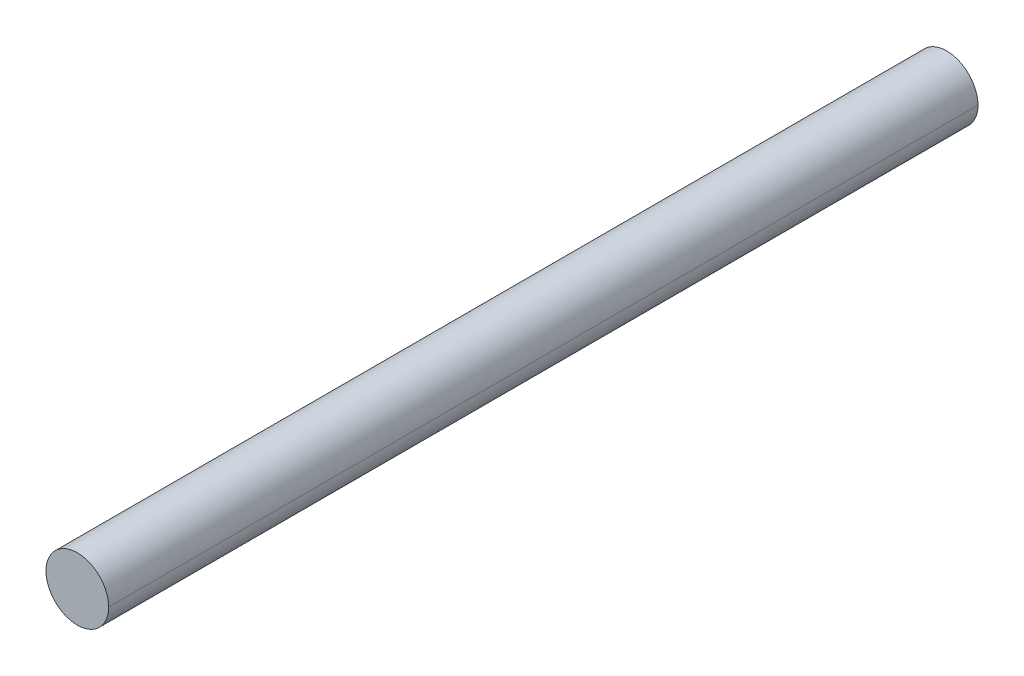
ISO-10303-21;
HEADER;
FILE_DESCRIPTION(('STEP AP214'),'2;1');
FILE_NAME('part.step','',(''),(''),'','','');
FILE_SCHEMA(('AUTOMOTIVE_DESIGN { 1 0 10303 214 1 1 1 1 }'));
ENDSEC;
DATA;
#1=APPLICATION_CONTEXT('core data for automotive mechanical design processes');
#2=APPLICATION_PROTOCOL_DEFINITION('international standard','automotive_design',2000,#1);
#3=PRODUCT_CONTEXT('',#1,'mechanical');
#4=PRODUCT('Part','Part','',(#3));
#5=PRODUCT_RELATED_PRODUCT_CATEGORY('part','',(#4));
#6=PRODUCT_DEFINITION_FORMATION('','',#4);
#7=PRODUCT_DEFINITION_CONTEXT('part definition',#1,'design');
#8=PRODUCT_DEFINITION('design','',#6,#7);
#9=PRODUCT_DEFINITION_SHAPE('','',#8);
#10=(LENGTH_UNIT() NAMED_UNIT(*) SI_UNIT(.MILLI.,.METRE.));
#11=(NAMED_UNIT(*) PLANE_ANGLE_UNIT() SI_UNIT($,.RADIAN.));
#12=(NAMED_UNIT(*) SI_UNIT($,.STERADIAN.) SOLID_ANGLE_UNIT());
#13=UNCERTAINTY_MEASURE_WITH_UNIT(LENGTH_MEASURE(1.E-05),#10,'distance_accuracy_value','');
#14=(GEOMETRIC_REPRESENTATION_CONTEXT(3) GLOBAL_UNCERTAINTY_ASSIGNED_CONTEXT((#13)) GLOBAL_UNIT_ASSIGNED_CONTEXT((#10,
#11,#12)) REPRESENTATION_CONTEXT('',''));
#15=CARTESIAN_POINT('',(0.,0.,0.));
#16=DIRECTION('',(0.,0.,1.));
#17=DIRECTION('',(1.,0.,0.));
#18=AXIS2_PLACEMENT_3D('',#15,#16,#17);
#19=CARTESIAN_POINT('',(0.,0.,0.));
#20=DIRECTION('',(0.,0.,1.));
#21=DIRECTION('',(1.,0.,0.));
#22=AXIS2_PLACEMENT_3D('',#19,#20,#21);
#23=PLANE('',#22);
#24=CARTESIAN_POINT('',(0.,0.,0.));
#25=DIRECTION('',(0.,0.,1.));
#26=DIRECTION('',(1.,0.,0.));
#27=AXIS2_PLACEMENT_3D('',#24,#25,#26);
#28=CIRCLE('',#27,4.);
#29=CARTESIAN_POINT('',(-4.,0.,0.));
#30=VERTEX_POINT('',#29);
#31=CARTESIAN_POINT('',(4.,0.,0.));
#32=VERTEX_POINT('',#31);
#33=EDGE_CURVE('E9',#30,#32,#28,.T.);
#34=ORIENTED_EDGE('',*,*,#33,.F.);
#35=CARTESIAN_POINT('',(0.,0.,0.));
#36=DIRECTION('',(0.,0.,1.));
#37=DIRECTION('',(1.,0.,0.));
#38=AXIS2_PLACEMENT_3D('',#35,#36,#37);
#39=CIRCLE('',#38,4.);
#40=EDGE_CURVE('E63',#32,#30,#39,.T.);
#41=ORIENTED_EDGE('',*,*,#40,.F.);
#42=EDGE_LOOP('',(#34,#41));
#43=FACE_BOUND('',#42,.T.);
#44=ADVANCED_FACE('F14',(#43),#23,.F.);
#45=CARTESIAN_POINT('',(0.,0.,111.));
#46=DIRECTION('',(0.,0.,1.));
#47=DIRECTION('',(1.,0.,0.));
#48=AXIS2_PLACEMENT_3D('',#45,#46,#47);
#49=PLANE('',#48);
#50=CARTESIAN_POINT('',(0.,0.,111.));
#51=DIRECTION('',(0.,0.,1.));
#52=DIRECTION('',(1.,0.,0.));
#53=AXIS2_PLACEMENT_3D('',#50,#51,#52);
#54=CIRCLE('',#53,4.);
#55=CARTESIAN_POINT('',(-4.,0.,111.));
#56=VERTEX_POINT('',#55);
#57=CARTESIAN_POINT('',(4.,0.,111.));
#58=VERTEX_POINT('',#57);
#59=EDGE_CURVE('E25',#56,#58,#54,.T.);
#60=ORIENTED_EDGE('',*,*,#59,.T.);
#61=CARTESIAN_POINT('',(0.,0.,111.));
#62=DIRECTION('',(0.,0.,1.));
#63=DIRECTION('',(1.,0.,0.));
#64=AXIS2_PLACEMENT_3D('',#61,#62,#63);
#65=CIRCLE('',#64,4.);
#66=EDGE_CURVE('E56',#58,#56,#65,.T.);
#67=ORIENTED_EDGE('',*,*,#66,.T.);
#68=EDGE_LOOP('',(#60,#67));
#69=FACE_BOUND('',#68,.T.);
#70=ADVANCED_FACE('F54',(#69),#49,.T.);
#71=CARTESIAN_POINT('',(0.,0.,111.));
#72=DIRECTION('',(0.,0.,-1.));
#73=DIRECTION('',(-1.,0.,0.));
#74=AXIS2_PLACEMENT_3D('',#71,#72,#73);
#75=CYLINDRICAL_SURFACE('',#74,4.);
#76=DIRECTION('',(0.,0.,-1.));
#77=VECTOR('',#76,1.);
#78=CARTESIAN_POINT('',(4.,0.,111.));
#79=LINE('',#78,#77);
#80=EDGE_CURVE('E59',#58,#32,#79,.T.);
#81=ORIENTED_EDGE('',*,*,#80,.F.);
#82=ORIENTED_EDGE('',*,*,#59,.F.);
#83=DIRECTION('',(0.,0.,-1.));
#84=VECTOR('',#83,1.);
#85=CARTESIAN_POINT('',(-4.,0.,111.));
#86=LINE('',#85,#84);
#87=EDGE_CURVE('E18',#56,#30,#86,.T.);
#88=ORIENTED_EDGE('',*,*,#87,.T.);
#89=ORIENTED_EDGE('',*,*,#33,.T.);
#90=EDGE_LOOP('',(#81,#82,#88,#89));
#91=FACE_BOUND('',#90,.T.);
#92=ADVANCED_FACE('F16',(#91),#75,.T.);
#93=CARTESIAN_POINT('',(0.,0.,111.));
#94=DIRECTION('',(0.,0.,-1.));
#95=DIRECTION('',(-1.,0.,0.));
#96=AXIS2_PLACEMENT_3D('',#93,#94,#95);
#97=CYLINDRICAL_SURFACE('',#96,4.);
#98=ORIENTED_EDGE('',*,*,#66,.F.);
#99=ORIENTED_EDGE('',*,*,#80,.T.);
#100=ORIENTED_EDGE('',*,*,#40,.T.);
#101=ORIENTED_EDGE('',*,*,#87,.F.);
#102=EDGE_LOOP('',(#98,#99,#100,#101));
#103=FACE_BOUND('',#102,.T.);
#104=ADVANCED_FACE('F65',(#103),#97,.T.);
#105=CLOSED_SHELL('',(#44,#70,#92,#104));
#106=MANIFOLD_SOLID_BREP('B1',#105);
#107=ADVANCED_BREP_SHAPE_REPRESENTATION('',(#18,#106),#14);
#108=SHAPE_DEFINITION_REPRESENTATION(#9,#107);
ENDSEC;
END-ISO-10303-21;
